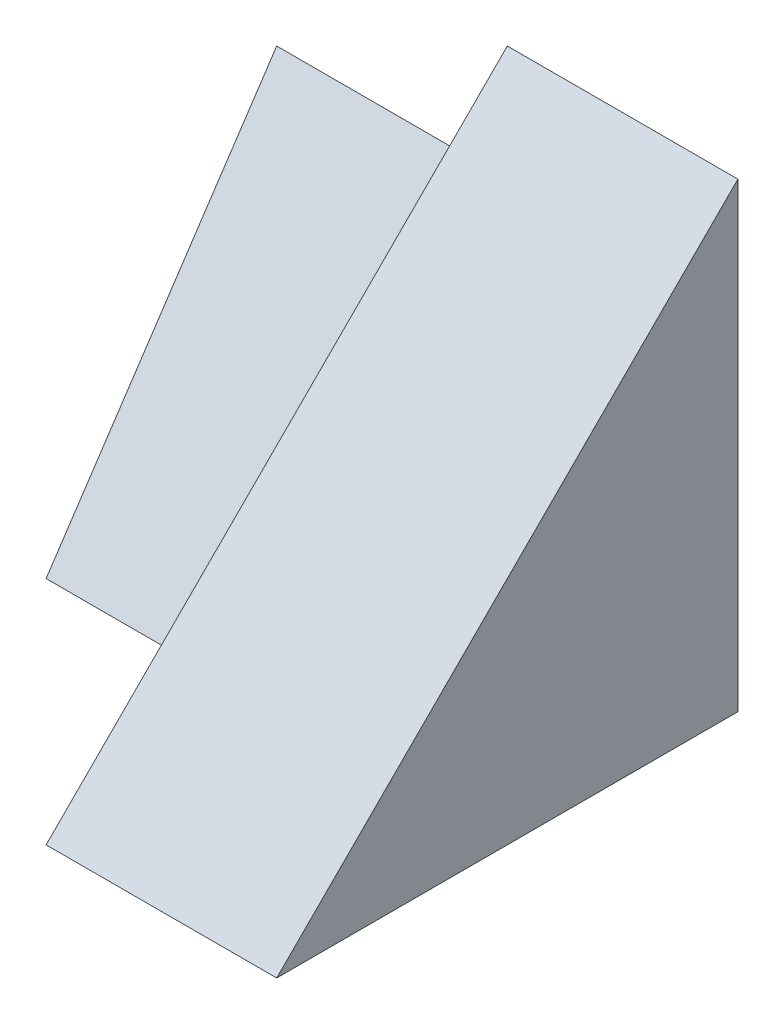
ISO-10303-21;
HEADER;
FILE_DESCRIPTION(('STEP AP214'),'2;1');
FILE_NAME('part.step','',(''),(''),'','','');
FILE_SCHEMA(('AUTOMOTIVE_DESIGN { 1 0 10303 214 1 1 1 1 }'));
ENDSEC;
DATA;
#1=APPLICATION_CONTEXT('core data for automotive mechanical design processes');
#2=APPLICATION_PROTOCOL_DEFINITION('international standard','automotive_design',2000,#1);
#3=PRODUCT_CONTEXT('',#1,'mechanical');
#4=PRODUCT('Part','Part','',(#3));
#5=PRODUCT_RELATED_PRODUCT_CATEGORY('part','',(#4));
#6=PRODUCT_DEFINITION_FORMATION('','',#4);
#7=PRODUCT_DEFINITION_CONTEXT('part definition',#1,'design');
#8=PRODUCT_DEFINITION('design','',#6,#7);
#9=PRODUCT_DEFINITION_SHAPE('','',#8);
#10=(LENGTH_UNIT() NAMED_UNIT(*) SI_UNIT(.MILLI.,.METRE.));
#11=(NAMED_UNIT(*) PLANE_ANGLE_UNIT() SI_UNIT($,.RADIAN.));
#12=(NAMED_UNIT(*) SI_UNIT($,.STERADIAN.) SOLID_ANGLE_UNIT());
#13=UNCERTAINTY_MEASURE_WITH_UNIT(LENGTH_MEASURE(1.E-05),#10,'distance_accuracy_value','');
#14=(GEOMETRIC_REPRESENTATION_CONTEXT(3) GLOBAL_UNCERTAINTY_ASSIGNED_CONTEXT((#13)) GLOBAL_UNIT_ASSIGNED_CONTEXT((#10,
#11,#12)) REPRESENTATION_CONTEXT('',''));
#15=CARTESIAN_POINT('',(0.,0.,0.));
#16=DIRECTION('',(0.,0.,1.));
#17=DIRECTION('',(1.,0.,0.));
#18=AXIS2_PLACEMENT_3D('',#15,#16,#17);
#19=CARTESIAN_POINT('',(2.,0.,0.));
#20=DIRECTION('',(0.,1.,0.));
#21=DIRECTION('',(0.,0.,1.));
#22=AXIS2_PLACEMENT_3D('',#19,#20,#21);
#23=PLANE('',#22);
#24=DIRECTION('',(0.,0.,-1.));
#25=VECTOR('',#24,1.);
#26=CARTESIAN_POINT('',(0.,0.,0.));
#27=LINE('',#26,#25);
#28=CARTESIAN_POINT('',(0.,0.,0.));
#29=VERTEX_POINT('',#28);
#30=CARTESIAN_POINT('',(0.,0.,-2.));
#31=VERTEX_POINT('',#30);
#32=EDGE_CURVE('E91',#29,#31,#27,.T.);
#33=ORIENTED_EDGE('',*,*,#32,.T.);
#34=DIRECTION('',(1.,0.,0.));
#35=VECTOR('',#34,1.);
#36=CARTESIAN_POINT('',(-2.,0.,-2.));
#37=LINE('',#36,#35);
#38=CARTESIAN_POINT('',(-2.,0.,-2.));
#39=VERTEX_POINT('',#38);
#40=EDGE_CURVE('E97',#39,#31,#37,.T.);
#41=ORIENTED_EDGE('',*,*,#40,.F.);
#42=DIRECTION('',(0.,0.,1.));
#43=VECTOR('',#42,1.);
#44=CARTESIAN_POINT('',(-2.,0.,-4.));
#45=LINE('',#44,#43);
#46=CARTESIAN_POINT('',(-2.,0.,-4.));
#47=VERTEX_POINT('',#46);
#48=EDGE_CURVE('E106',#47,#39,#45,.T.);
#49=ORIENTED_EDGE('',*,*,#48,.F.);
#50=DIRECTION('',(-1.,0.,0.));
#51=VECTOR('',#50,1.);
#52=CARTESIAN_POINT('',(2.,0.,-4.));
#53=LINE('',#52,#51);
#54=CARTESIAN_POINT('',(2.,0.,-4.));
#55=VERTEX_POINT('',#54);
#56=EDGE_CURVE('E42',#55,#47,#53,.T.);
#57=ORIENTED_EDGE('',*,*,#56,.F.);
#58=DIRECTION('',(0.,0.,-1.));
#59=VECTOR('',#58,1.);
#60=CARTESIAN_POINT('',(2.,0.,0.));
#61=LINE('',#60,#59);
#62=CARTESIAN_POINT('',(2.,0.,0.));
#63=VERTEX_POINT('',#62);
#64=EDGE_CURVE('E49',#63,#55,#61,.T.);
#65=ORIENTED_EDGE('',*,*,#64,.F.);
#66=DIRECTION('',(-1.,0.,0.));
#67=VECTOR('',#66,1.);
#68=CARTESIAN_POINT('',(2.,0.,0.));
#69=LINE('',#68,#67);
#70=EDGE_CURVE('E11',#63,#29,#69,.T.);
#71=ORIENTED_EDGE('',*,*,#70,.T.);
#72=EDGE_LOOP('',(#33,#41,#49,#57,#65,#71));
#73=FACE_BOUND('',#72,.T.);
#74=ADVANCED_FACE('F33',(#73),#23,.F.);
#75=CARTESIAN_POINT('',(2.,0.,-4.));
#76=DIRECTION('',(0.,0.,1.));
#77=DIRECTION('',(1.,0.,0.));
#78=AXIS2_PLACEMENT_3D('',#75,#76,#77);
#79=PLANE('',#78);
#80=ORIENTED_EDGE('',*,*,#56,.T.);
#81=DIRECTION('',(0.,-1.,0.));
#82=VECTOR('',#81,1.);
#83=CARTESIAN_POINT('',(-2.,0.,-4.));
#84=LINE('',#83,#82);
#85=CARTESIAN_POINT('',(-2.,3.,-4.));
#86=VERTEX_POINT('',#85);
#87=EDGE_CURVE('E121',#86,#47,#84,.T.);
#88=ORIENTED_EDGE('',*,*,#87,.F.);
#89=DIRECTION('',(1.,0.,0.));
#90=VECTOR('',#89,1.);
#91=CARTESIAN_POINT('',(-2.,3.,-4.));
#92=LINE('',#91,#90);
#93=CARTESIAN_POINT('',(0.,3.,-4.));
#94=VERTEX_POINT('',#93);
#95=EDGE_CURVE('E115',#86,#94,#92,.T.);
#96=ORIENTED_EDGE('',*,*,#95,.T.);
#97=DIRECTION('',(0.,1.,0.));
#98=VECTOR('',#97,1.);
#99=CARTESIAN_POINT('',(0.,0.,-4.));
#100=LINE('',#99,#98);
#101=CARTESIAN_POINT('',(0.,4.,-4.));
#102=VERTEX_POINT('',#101);
#103=EDGE_CURVE('E96',#94,#102,#100,.T.);
#104=ORIENTED_EDGE('',*,*,#103,.T.);
#105=DIRECTION('',(-1.,0.,0.));
#106=VECTOR('',#105,1.);
#107=CARTESIAN_POINT('',(2.,4.,-4.));
#108=LINE('',#107,#106);
#109=CARTESIAN_POINT('',(2.,4.,-4.));
#110=VERTEX_POINT('',#109);
#111=EDGE_CURVE('E82',#110,#102,#108,.T.);
#112=ORIENTED_EDGE('',*,*,#111,.F.);
#113=DIRECTION('',(0.,1.,0.));
#114=VECTOR('',#113,1.);
#115=CARTESIAN_POINT('',(2.,0.,-4.));
#116=LINE('',#115,#114);
#117=EDGE_CURVE('E101',#55,#110,#116,.T.);
#118=ORIENTED_EDGE('',*,*,#117,.F.);
#119=EDGE_LOOP('',(#80,#88,#96,#104,#112,#118));
#120=FACE_BOUND('',#119,.T.);
#121=ADVANCED_FACE('F130',(#120),#79,.F.);
#122=CARTESIAN_POINT('',(2.,0.,0.));
#123=DIRECTION('',(-1.,0.,0.));
#124=DIRECTION('',(0.,0.,1.));
#125=AXIS2_PLACEMENT_3D('',#122,#123,#124);
#126=PLANE('',#125);
#127=ORIENTED_EDGE('',*,*,#117,.T.);
#128=DIRECTION('',(0.,0.707106781186548,-0.707106781186548));
#129=VECTOR('',#128,1.);
#130=CARTESIAN_POINT('',(2.,4.,-4.));
#131=LINE('',#130,#129);
#132=EDGE_CURVE('E87',#63,#110,#131,.T.);
#133=ORIENTED_EDGE('',*,*,#132,.F.);
#134=ORIENTED_EDGE('',*,*,#64,.T.);
#135=EDGE_LOOP('',(#127,#133,#134));
#136=FACE_BOUND('',#135,.T.);
#137=ADVANCED_FACE('F128',(#136),#126,.F.);
#138=CARTESIAN_POINT('',(0.,0.,0.));
#139=DIRECTION('',(-1.,0.,0.));
#140=DIRECTION('',(0.,0.,1.));
#141=AXIS2_PLACEMENT_3D('',#138,#139,#140);
#142=PLANE('',#141);
#143=DIRECTION('',(0.,0.707106781186548,-0.707106781186548));
#144=VECTOR('',#143,1.);
#145=CARTESIAN_POINT('',(0.,4.,-4.));
#146=LINE('',#145,#144);
#147=EDGE_CURVE('E78',#29,#102,#146,.T.);
#148=ORIENTED_EDGE('',*,*,#147,.T.);
#149=ORIENTED_EDGE('',*,*,#103,.F.);
#150=DIRECTION('',(0.,-0.832050294337844,0.554700196225229));
#151=VECTOR('',#150,1.);
#152=CARTESIAN_POINT('',(0.,0.,-2.));
#153=LINE('',#152,#151);
#154=EDGE_CURVE('E93',#94,#31,#153,.T.);
#155=ORIENTED_EDGE('',*,*,#154,.T.);
#156=ORIENTED_EDGE('',*,*,#32,.F.);
#157=EDGE_LOOP('',(#148,#149,#155,#156));
#158=FACE_BOUND('',#157,.T.);
#159=ADVANCED_FACE('F92',(#158),#142,.T.);
#160=CARTESIAN_POINT('',(-2.,0.,0.));
#161=DIRECTION('',(1.,0.,0.));
#162=DIRECTION('',(0.,0.,-1.));
#163=AXIS2_PLACEMENT_3D('',#160,#161,#162);
#164=PLANE('',#163);
#165=ORIENTED_EDGE('',*,*,#48,.T.);
#166=DIRECTION('',(0.,-0.832050294337844,0.554700196225229));
#167=VECTOR('',#166,1.);
#168=CARTESIAN_POINT('',(-2.,0.,-2.));
#169=LINE('',#168,#167);
#170=EDGE_CURVE('E86',#86,#39,#169,.T.);
#171=ORIENTED_EDGE('',*,*,#170,.F.);
#172=ORIENTED_EDGE('',*,*,#87,.T.);
#173=EDGE_LOOP('',(#165,#171,#172));
#174=FACE_BOUND('',#173,.T.);
#175=ADVANCED_FACE('F134',(#174),#164,.F.);
#176=CARTESIAN_POINT('',(0.,0.,-2.));
#177=DIRECTION('',(0.,-0.554700196225229,-0.832050294337844));
#178=DIRECTION('',(0.,0.832050294337844,-0.554700196225229));
#179=AXIS2_PLACEMENT_3D('',#176,#177,#178);
#180=PLANE('',#179);
#181=ORIENTED_EDGE('',*,*,#170,.T.);
#182=ORIENTED_EDGE('',*,*,#40,.T.);
#183=ORIENTED_EDGE('',*,*,#154,.F.);
#184=ORIENTED_EDGE('',*,*,#95,.F.);
#185=EDGE_LOOP('',(#181,#182,#183,#184));
#186=FACE_BOUND('',#185,.T.);
#187=ADVANCED_FACE('F136',(#186),#180,.F.);
#188=CARTESIAN_POINT('',(0.,4.,-4.));
#189=DIRECTION('',(0.,-0.707106781186547,-0.707106781186547));
#190=DIRECTION('',(0.,0.707106781186548,-0.707106781186548));
#191=AXIS2_PLACEMENT_3D('',#188,#189,#190);
#192=PLANE('',#191);
#193=ORIENTED_EDGE('',*,*,#132,.T.);
#194=ORIENTED_EDGE('',*,*,#111,.T.);
#195=ORIENTED_EDGE('',*,*,#147,.F.);
#196=ORIENTED_EDGE('',*,*,#70,.F.);
#197=EDGE_LOOP('',(#193,#194,#195,#196));
#198=FACE_BOUND('',#197,.T.);
#199=ADVANCED_FACE('F80',(#198),#192,.F.);
#200=CLOSED_SHELL('',(#74,#121,#137,#159,#175,#187,#199));
#201=MANIFOLD_SOLID_BREP('B2',#200);
#202=ADVANCED_BREP_SHAPE_REPRESENTATION('',(#18,#201),#14);
#203=SHAPE_DEFINITION_REPRESENTATION(#9,#202);
ENDSEC;
END-ISO-10303-21;
